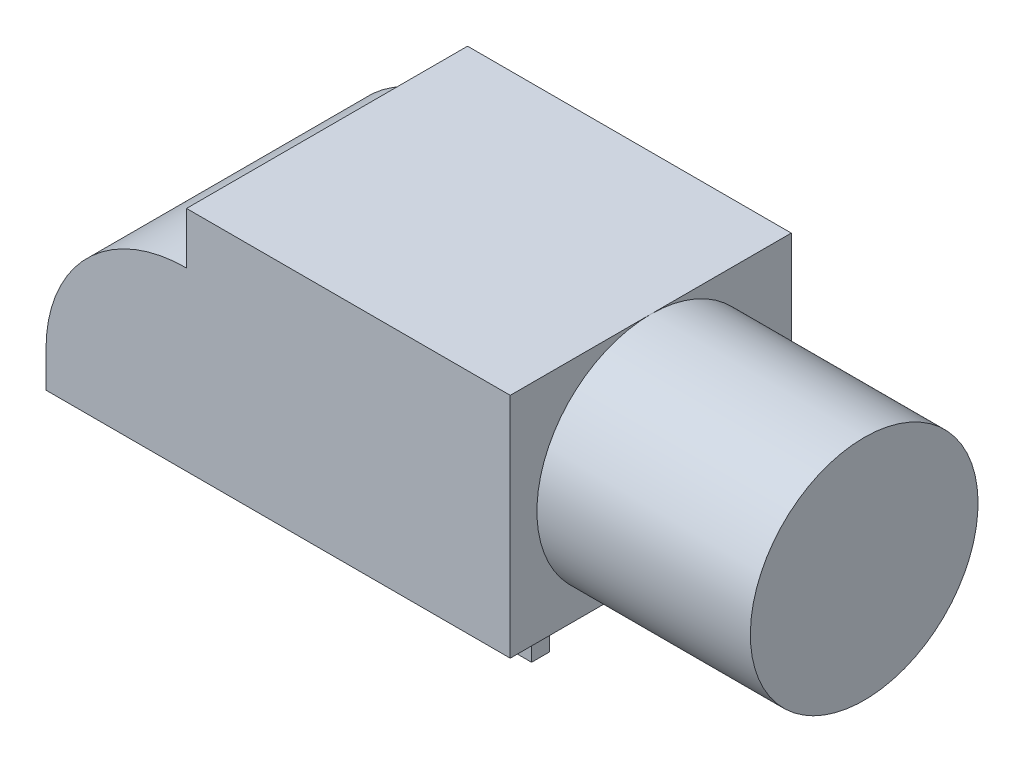
ISO-10303-21;
HEADER;
FILE_DESCRIPTION(('STEP AP214'),'2;1');
FILE_NAME('part.step','',(''),(''),'','','');
FILE_SCHEMA(('AUTOMOTIVE_DESIGN { 1 0 10303 214 1 1 1 1 }'));
ENDSEC;
DATA;
#1=APPLICATION_CONTEXT('core data for automotive mechanical design processes');
#2=APPLICATION_PROTOCOL_DEFINITION('international standard','automotive_design',2000,#1);
#3=PRODUCT_CONTEXT('',#1,'mechanical');
#4=PRODUCT('Part','Part','',(#3));
#5=PRODUCT_RELATED_PRODUCT_CATEGORY('part','',(#4));
#6=PRODUCT_DEFINITION_FORMATION('','',#4);
#7=PRODUCT_DEFINITION_CONTEXT('part definition',#1,'design');
#8=PRODUCT_DEFINITION('design','',#6,#7);
#9=PRODUCT_DEFINITION_SHAPE('','',#8);
#10=(LENGTH_UNIT() NAMED_UNIT(*) SI_UNIT(.MILLI.,.METRE.));
#11=(NAMED_UNIT(*) PLANE_ANGLE_UNIT() SI_UNIT($,.RADIAN.));
#12=(NAMED_UNIT(*) SI_UNIT($,.STERADIAN.) SOLID_ANGLE_UNIT());
#13=UNCERTAINTY_MEASURE_WITH_UNIT(LENGTH_MEASURE(1.E-05),#10,'distance_accuracy_value','');
#14=(GEOMETRIC_REPRESENTATION_CONTEXT(3) GLOBAL_UNCERTAINTY_ASSIGNED_CONTEXT((#13)) GLOBAL_UNIT_ASSIGNED_CONTEXT((#10,
#11,#12)) REPRESENTATION_CONTEXT('',''));
#15=CARTESIAN_POINT('',(0.,0.,0.));
#16=DIRECTION('',(0.,0.,1.));
#17=DIRECTION('',(1.,0.,0.));
#18=AXIS2_PLACEMENT_3D('',#15,#16,#17);
#19=CARTESIAN_POINT('',(-7.875,-4.2,0.));
#20=DIRECTION('',(0.,1.,0.));
#21=DIRECTION('',(0.,0.,1.));
#22=AXIS2_PLACEMENT_3D('',#19,#20,#21);
#23=CYLINDRICAL_SURFACE('',#22,0.75);
#24=CARTESIAN_POINT('',(-7.875,-3.2,0.));
#25=DIRECTION('',(0.,-1.,0.));
#26=DIRECTION('',(0.,0.,1.));
#27=AXIS2_PLACEMENT_3D('',#24,#25,#26);
#28=CIRCLE('',#27,0.75);
#29=CARTESIAN_POINT('',(-7.875,-3.2,0.75));
#30=VERTEX_POINT('',#29);
#31=EDGE_CURVE('E11',#30,#30,#28,.T.);
#32=ORIENTED_EDGE('',*,*,#31,.T.);
#33=EDGE_LOOP('',(#32));
#34=FACE_BOUND('',#33,.T.);
#35=CARTESIAN_POINT('',(-7.875,-4.2,0.));
#36=DIRECTION('',(0.,-1.,0.));
#37=DIRECTION('',(0.,0.,-1.));
#38=AXIS2_PLACEMENT_3D('',#35,#36,#37);
#39=CIRCLE('',#38,0.75);
#40=CARTESIAN_POINT('',(-7.875,-4.2,-0.75));
#41=VERTEX_POINT('',#40);
#42=EDGE_CURVE('E146',#41,#41,#39,.T.);
#43=ORIENTED_EDGE('',*,*,#42,.F.);
#44=EDGE_LOOP('',(#43));
#45=FACE_BOUND('',#44,.T.);
#46=ADVANCED_FACE('F17',(#34,#45),#23,.T.);
#47=CARTESIAN_POINT('',(3.525,0.,0.));
#48=DIRECTION('',(1.,0.,0.));
#49=DIRECTION('',(0.,1.,0.));
#50=AXIS2_PLACEMENT_3D('',#47,#48,#49);
#51=CYLINDRICAL_SURFACE('',#50,3.2);
#52=CARTESIAN_POINT('',(9.525,0.,0.));
#53=DIRECTION('',(1.,0.,0.));
#54=DIRECTION('',(0.,1.,0.));
#55=AXIS2_PLACEMENT_3D('',#52,#53,#54);
#56=CIRCLE('',#55,3.2);
#57=CARTESIAN_POINT('',(9.525,3.2,0.));
#58=VERTEX_POINT('',#57);
#59=EDGE_CURVE('E200',#58,#58,#56,.T.);
#60=ORIENTED_EDGE('',*,*,#59,.F.);
#61=EDGE_LOOP('',(#60));
#62=FACE_BOUND('',#61,.T.);
#63=CARTESIAN_POINT('',(3.525,0.,0.));
#64=DIRECTION('',(1.,0.,0.));
#65=DIRECTION('',(0.,1.,0.));
#66=AXIS2_PLACEMENT_3D('',#63,#64,#65);
#67=CIRCLE('',#66,3.2);
#68=CARTESIAN_POINT('',(3.525,3.2,0.));
#69=VERTEX_POINT('',#68);
#70=CARTESIAN_POINT('',(3.525,-3.2,0.));
#71=VERTEX_POINT('',#70);
#72=EDGE_CURVE('E27',#69,#71,#67,.T.);
#73=ORIENTED_EDGE('',*,*,#72,.T.);
#74=CARTESIAN_POINT('',(3.525,0.,0.));
#75=DIRECTION('',(1.,0.,0.));
#76=DIRECTION('',(0.,1.,0.));
#77=AXIS2_PLACEMENT_3D('',#74,#75,#76);
#78=CIRCLE('',#77,3.2);
#79=EDGE_CURVE('E186',#71,#69,#78,.T.);
#80=ORIENTED_EDGE('',*,*,#79,.T.);
#81=EDGE_LOOP('',(#73,#80));
#82=FACE_BOUND('',#81,.T.);
#83=ADVANCED_FACE('F257',(#62,#82),#51,.T.);
#84=CARTESIAN_POINT('',(-9.525,-3.2,3.95));
#85=DIRECTION('',(0.,1.,0.));
#86=DIRECTION('',(0.,0.,1.));
#87=AXIS2_PLACEMENT_3D('',#84,#85,#86);
#88=PLANE('',#87);
#89=ORIENTED_EDGE('',*,*,#31,.F.);
#90=EDGE_LOOP('',(#89));
#91=FACE_BOUND('',#90,.T.);
#92=DIRECTION('',(0.,0.,1.));
#93=VECTOR('',#92,1.);
#94=CARTESIAN_POINT('',(2.925,-3.2,2.75));
#95=LINE('',#94,#93);
#96=CARTESIAN_POINT('',(2.925,-3.2,2.25));
#97=VERTEX_POINT('',#96);
#98=CARTESIAN_POINT('',(2.925,-3.2,2.75));
#99=VERTEX_POINT('',#98);
#100=EDGE_CURVE('E180',#97,#99,#95,.T.);
#101=ORIENTED_EDGE('',*,*,#100,.F.);
#102=DIRECTION('',(1.,0.,0.));
#103=VECTOR('',#102,1.);
#104=CARTESIAN_POINT('',(1.725,-3.2,2.25));
#105=LINE('',#104,#103);
#106=CARTESIAN_POINT('',(1.725,-3.2,2.25));
#107=VERTEX_POINT('',#106);
#108=EDGE_CURVE('E170',#107,#97,#105,.T.);
#109=ORIENTED_EDGE('',*,*,#108,.F.);
#110=DIRECTION('',(0.,0.,-1.));
#111=VECTOR('',#110,1.);
#112=CARTESIAN_POINT('',(1.725,-3.2,2.75));
#113=LINE('',#112,#111);
#114=CARTESIAN_POINT('',(1.725,-3.2,2.75));
#115=VERTEX_POINT('',#114);
#116=EDGE_CURVE('E176',#115,#107,#113,.T.);
#117=ORIENTED_EDGE('',*,*,#116,.F.);
#118=DIRECTION('',(-1.,0.,0.));
#119=VECTOR('',#118,1.);
#120=CARTESIAN_POINT('',(1.725,-3.2,2.75));
#121=LINE('',#120,#119);
#122=EDGE_CURVE('E181',#99,#115,#121,.T.);
#123=ORIENTED_EDGE('',*,*,#122,.F.);
#124=EDGE_LOOP('',(#101,#109,#117,#123));
#125=FACE_BOUND('',#124,.T.);
#126=DIRECTION('',(0.,0.,-1.));
#127=VECTOR('',#126,1.);
#128=CARTESIAN_POINT('',(3.525,-3.2,3.95));
#129=LINE('',#128,#127);
#130=CARTESIAN_POINT('',(3.525,-3.2,3.95));
#131=VERTEX_POINT('',#130);
#132=EDGE_CURVE('E222',#131,#71,#129,.T.);
#133=ORIENTED_EDGE('',*,*,#132,.F.);
#134=DIRECTION('',(1.,0.,0.));
#135=VECTOR('',#134,1.);
#136=CARTESIAN_POINT('',(-9.525,-3.2,3.95));
#137=LINE('',#136,#135);
#138=CARTESIAN_POINT('',(-9.525,-3.2,3.95));
#139=VERTEX_POINT('',#138);
#140=EDGE_CURVE('E210',#139,#131,#137,.T.);
#141=ORIENTED_EDGE('',*,*,#140,.F.);
#142=DIRECTION('',(0.,0.,-1.));
#143=VECTOR('',#142,1.);
#144=CARTESIAN_POINT('',(-9.525,-3.2,3.95));
#145=LINE('',#144,#143);
#146=CARTESIAN_POINT('',(-9.525,-3.2,-3.95));
#147=VERTEX_POINT('',#146);
#148=EDGE_CURVE('E238',#139,#147,#145,.T.);
#149=ORIENTED_EDGE('',*,*,#148,.T.);
#150=DIRECTION('',(1.,0.,0.));
#151=VECTOR('',#150,1.);
#152=CARTESIAN_POINT('',(-9.525,-3.2,-3.95));
#153=LINE('',#152,#151);
#154=CARTESIAN_POINT('',(3.525,-3.2,-3.95));
#155=VERTEX_POINT('',#154);
#156=EDGE_CURVE('E229',#147,#155,#153,.T.);
#157=ORIENTED_EDGE('',*,*,#156,.T.);
#158=DIRECTION('',(0.,0.,-1.));
#159=VECTOR('',#158,1.);
#160=CARTESIAN_POINT('',(3.525,-3.2,3.95));
#161=LINE('',#160,#159);
#162=EDGE_CURVE('E36',#71,#155,#161,.T.);
#163=ORIENTED_EDGE('',*,*,#162,.F.);
#164=EDGE_LOOP('',(#133,#141,#149,#157,#163));
#165=FACE_BOUND('',#164,.T.);
#166=DIRECTION('',(0.,0.,1.));
#167=VECTOR('',#166,1.);
#168=CARTESIAN_POINT('',(2.925,-3.2,-2.25));
#169=LINE('',#168,#167);
#170=CARTESIAN_POINT('',(2.925,-3.2,-2.75));
#171=VERTEX_POINT('',#170);
#172=CARTESIAN_POINT('',(2.925,-3.2,-2.25));
#173=VERTEX_POINT('',#172);
#174=EDGE_CURVE('E155',#171,#173,#169,.T.);
#175=ORIENTED_EDGE('',*,*,#174,.F.);
#176=DIRECTION('',(1.,0.,0.));
#177=VECTOR('',#176,1.);
#178=CARTESIAN_POINT('',(1.725,-3.2,-2.75));
#179=LINE('',#178,#177);
#180=CARTESIAN_POINT('',(1.725,-3.2,-2.75));
#181=VERTEX_POINT('',#180);
#182=EDGE_CURVE('E139',#181,#171,#179,.T.);
#183=ORIENTED_EDGE('',*,*,#182,.F.);
#184=DIRECTION('',(0.,0.,-1.));
#185=VECTOR('',#184,1.);
#186=CARTESIAN_POINT('',(1.725,-3.2,-2.25));
#187=LINE('',#186,#185);
#188=CARTESIAN_POINT('',(1.725,-3.2,-2.25));
#189=VERTEX_POINT('',#188);
#190=EDGE_CURVE('E137',#189,#181,#187,.T.);
#191=ORIENTED_EDGE('',*,*,#190,.F.);
#192=DIRECTION('',(-1.,0.,0.));
#193=VECTOR('',#192,1.);
#194=CARTESIAN_POINT('',(1.725,-3.2,-2.25));
#195=LINE('',#194,#193);
#196=EDGE_CURVE('E156',#173,#189,#195,.T.);
#197=ORIENTED_EDGE('',*,*,#196,.F.);
#198=EDGE_LOOP('',(#175,#183,#191,#197));
#199=FACE_BOUND('',#198,.T.);
#200=ADVANCED_FACE('F274',(#91,#125,#165,#199),#88,.F.);
#201=CARTESIAN_POINT('',(-9.525,3.2,3.95));
#202=DIRECTION('',(0.,-1.,0.));
#203=DIRECTION('',(0.,0.,-1.));
#204=AXIS2_PLACEMENT_3D('',#201,#202,#203);
#205=PLANE('',#204);
#206=DIRECTION('',(-1.,0.,0.));
#207=VECTOR('',#206,1.);
#208=CARTESIAN_POINT('',(-9.525,3.2,-3.95));
#209=LINE('',#208,#207);
#210=CARTESIAN_POINT('',(3.525,3.2,-3.95));
#211=VERTEX_POINT('',#210);
#212=CARTESIAN_POINT('',(-5.575,3.2,-3.95));
#213=VERTEX_POINT('',#212);
#214=EDGE_CURVE('E214',#211,#213,#209,.T.);
#215=ORIENTED_EDGE('',*,*,#214,.T.);
#216=DIRECTION('',(0.,0.,-1.));
#217=VECTOR('',#216,1.);
#218=CARTESIAN_POINT('',(-5.575,3.2,31.338196020366));
#219=LINE('',#218,#217);
#220=CARTESIAN_POINT('',(-5.575,3.2,3.95));
#221=VERTEX_POINT('',#220);
#222=EDGE_CURVE('E217',#221,#213,#219,.T.);
#223=ORIENTED_EDGE('',*,*,#222,.F.);
#224=DIRECTION('',(-1.,0.,0.));
#225=VECTOR('',#224,1.);
#226=CARTESIAN_POINT('',(-9.525,3.2,3.95));
#227=LINE('',#226,#225);
#228=CARTESIAN_POINT('',(3.525,3.2,3.95));
#229=VERTEX_POINT('',#228);
#230=EDGE_CURVE('E206',#229,#221,#227,.T.);
#231=ORIENTED_EDGE('',*,*,#230,.F.);
#232=DIRECTION('',(0.,0.,1.));
#233=VECTOR('',#232,1.);
#234=CARTESIAN_POINT('',(3.525,3.2,3.95));
#235=LINE('',#234,#233);
#236=EDGE_CURVE('E190',#69,#229,#235,.T.);
#237=ORIENTED_EDGE('',*,*,#236,.F.);
#238=DIRECTION('',(0.,0.,1.));
#239=VECTOR('',#238,1.);
#240=CARTESIAN_POINT('',(3.525,3.2,3.95));
#241=LINE('',#240,#239);
#242=EDGE_CURVE('E220',#211,#69,#241,.T.);
#243=ORIENTED_EDGE('',*,*,#242,.F.);
#244=EDGE_LOOP('',(#215,#223,#231,#237,#243));
#245=FACE_BOUND('',#244,.T.);
#246=ADVANCED_FACE('F266',(#245),#205,.F.);
#247=CARTESIAN_POINT('',(0.,0.,3.95));
#248=DIRECTION('',(0.,0.,1.));
#249=DIRECTION('',(1.,0.,0.));
#250=AXIS2_PLACEMENT_3D('',#247,#248,#249);
#251=PLANE('',#250);
#252=DIRECTION('',(0.,1.,0.));
#253=VECTOR('',#252,1.);
#254=CARTESIAN_POINT('',(-5.575,0.,3.95));
#255=LINE('',#254,#253);
#256=CARTESIAN_POINT('',(-5.575,1.75,3.95));
#257=VERTEX_POINT('',#256);
#258=EDGE_CURVE('E148',#257,#221,#255,.T.);
#259=ORIENTED_EDGE('',*,*,#258,.F.);
#260=CARTESIAN_POINT('',(-5.575,-2.2,3.95));
#261=DIRECTION('',(0.,0.,-1.));
#262=DIRECTION('',(1.,0.,0.));
#263=AXIS2_PLACEMENT_3D('',#260,#261,#262);
#264=CIRCLE('',#263,3.95);
#265=CARTESIAN_POINT('',(-9.525,-2.2,3.95));
#266=VERTEX_POINT('',#265);
#267=EDGE_CURVE('E215',#266,#257,#264,.T.);
#268=ORIENTED_EDGE('',*,*,#267,.F.);
#269=DIRECTION('',(0.,-1.,0.));
#270=VECTOR('',#269,1.);
#271=CARTESIAN_POINT('',(-9.525,3.2,3.95));
#272=LINE('',#271,#270);
#273=EDGE_CURVE('E211',#266,#139,#272,.T.);
#274=ORIENTED_EDGE('',*,*,#273,.T.);
#275=ORIENTED_EDGE('',*,*,#140,.T.);
#276=DIRECTION('',(0.,1.,0.));
#277=VECTOR('',#276,1.);
#278=CARTESIAN_POINT('',(3.525,0.,3.95));
#279=LINE('',#278,#277);
#280=EDGE_CURVE('E207',#131,#229,#279,.T.);
#281=ORIENTED_EDGE('',*,*,#280,.T.);
#282=ORIENTED_EDGE('',*,*,#230,.T.);
#283=EDGE_LOOP('',(#259,#268,#274,#275,#281,#282));
#284=FACE_BOUND('',#283,.T.);
#285=ADVANCED_FACE('F271',(#284),#251,.T.);
#286=CARTESIAN_POINT('',(0.,0.,-3.95));
#287=DIRECTION('',(0.,0.,1.));
#288=DIRECTION('',(1.,0.,0.));
#289=AXIS2_PLACEMENT_3D('',#286,#287,#288);
#290=PLANE('',#289);
#291=CARTESIAN_POINT('',(-5.575,-2.2,-3.95));
#292=DIRECTION('',(0.,0.,-1.));
#293=DIRECTION('',(1.,0.,0.));
#294=AXIS2_PLACEMENT_3D('',#291,#292,#293);
#295=CIRCLE('',#294,3.95);
#296=CARTESIAN_POINT('',(-9.525,-2.2,-3.95));
#297=VERTEX_POINT('',#296);
#298=CARTESIAN_POINT('',(-5.575,1.75,-3.95));
#299=VERTEX_POINT('',#298);
#300=EDGE_CURVE('E203',#297,#299,#295,.T.);
#301=ORIENTED_EDGE('',*,*,#300,.T.);
#302=DIRECTION('',(0.,1.,0.));
#303=VECTOR('',#302,1.);
#304=CARTESIAN_POINT('',(-5.575,0.,-3.95));
#305=LINE('',#304,#303);
#306=EDGE_CURVE('E194',#299,#213,#305,.T.);
#307=ORIENTED_EDGE('',*,*,#306,.T.);
#308=ORIENTED_EDGE('',*,*,#214,.F.);
#309=DIRECTION('',(0.,1.,0.));
#310=VECTOR('',#309,1.);
#311=CARTESIAN_POINT('',(3.525,0.,-3.95));
#312=LINE('',#311,#310);
#313=EDGE_CURVE('E197',#155,#211,#312,.T.);
#314=ORIENTED_EDGE('',*,*,#313,.F.);
#315=ORIENTED_EDGE('',*,*,#156,.F.);
#316=DIRECTION('',(0.,-1.,0.));
#317=VECTOR('',#316,1.);
#318=CARTESIAN_POINT('',(-9.525,3.2,-3.95));
#319=LINE('',#318,#317);
#320=EDGE_CURVE('E189',#297,#147,#319,.T.);
#321=ORIENTED_EDGE('',*,*,#320,.F.);
#322=EDGE_LOOP('',(#301,#307,#308,#314,#315,#321));
#323=FACE_BOUND('',#322,.T.);
#324=ADVANCED_FACE('F281',(#323),#290,.F.);
#325=CARTESIAN_POINT('',(-9.525,3.2,3.95));
#326=DIRECTION('',(1.,0.,0.));
#327=DIRECTION('',(0.,0.,-1.));
#328=AXIS2_PLACEMENT_3D('',#325,#326,#327);
#329=PLANE('',#328);
#330=ORIENTED_EDGE('',*,*,#273,.F.);
#331=DIRECTION('',(0.,0.,-1.));
#332=VECTOR('',#331,1.);
#333=CARTESIAN_POINT('',(-9.525,-2.2,31.338196020366));
#334=LINE('',#333,#332);
#335=EDGE_CURVE('E191',#266,#297,#334,.T.);
#336=ORIENTED_EDGE('',*,*,#335,.T.);
#337=ORIENTED_EDGE('',*,*,#320,.T.);
#338=ORIENTED_EDGE('',*,*,#148,.F.);
#339=EDGE_LOOP('',(#330,#336,#337,#338));
#340=FACE_BOUND('',#339,.T.);
#341=ADVANCED_FACE('F277',(#340),#329,.F.);
#342=CARTESIAN_POINT('',(3.525,0.,0.));
#343=DIRECTION('',(1.,0.,0.));
#344=DIRECTION('',(0.,1.,0.));
#345=AXIS2_PLACEMENT_3D('',#342,#343,#344);
#346=PLANE('',#345);
#347=ORIENTED_EDGE('',*,*,#236,.T.);
#348=ORIENTED_EDGE('',*,*,#280,.F.);
#349=ORIENTED_EDGE('',*,*,#132,.T.);
#350=ORIENTED_EDGE('',*,*,#72,.F.);
#351=EDGE_LOOP('',(#347,#348,#349,#350));
#352=FACE_BOUND('',#351,.T.);
#353=ADVANCED_FACE('F268',(#352),#346,.T.);
#354=CARTESIAN_POINT('',(3.525,0.,0.));
#355=DIRECTION('',(1.,0.,0.));
#356=DIRECTION('',(0.,1.,0.));
#357=AXIS2_PLACEMENT_3D('',#354,#355,#356);
#358=PLANE('',#357);
#359=ORIENTED_EDGE('',*,*,#242,.T.);
#360=ORIENTED_EDGE('',*,*,#79,.F.);
#361=ORIENTED_EDGE('',*,*,#162,.T.);
#362=ORIENTED_EDGE('',*,*,#313,.T.);
#363=EDGE_LOOP('',(#359,#360,#361,#362));
#364=FACE_BOUND('',#363,.T.);
#365=ADVANCED_FACE('F260',(#364),#358,.T.);
#366=CARTESIAN_POINT('',(9.525,3.2,3.95));
#367=DIRECTION('',(-1.,0.,0.));
#368=DIRECTION('',(0.,0.,1.));
#369=AXIS2_PLACEMENT_3D('',#366,#367,#368);
#370=PLANE('',#369);
#371=ORIENTED_EDGE('',*,*,#59,.T.);
#372=EDGE_LOOP('',(#371));
#373=FACE_BOUND('',#372,.T.);
#374=ADVANCED_FACE('F321',(#373),#370,.F.);
#375=CARTESIAN_POINT('',(2.925,-4.2,2.75));
#376=DIRECTION('',(-1.,0.,0.));
#377=DIRECTION('',(0.,0.,1.));
#378=AXIS2_PLACEMENT_3D('',#375,#376,#377);
#379=PLANE('',#378);
#380=ORIENTED_EDGE('',*,*,#100,.T.);
#381=DIRECTION('',(0.,1.,0.));
#382=VECTOR('',#381,1.);
#383=CARTESIAN_POINT('',(2.925,-4.2,2.75));
#384=LINE('',#383,#382);
#385=CARTESIAN_POINT('',(2.925,-4.2,2.75));
#386=VERTEX_POINT('',#385);
#387=EDGE_CURVE('E183',#386,#99,#384,.T.);
#388=ORIENTED_EDGE('',*,*,#387,.F.);
#389=DIRECTION('',(0.,0.,1.));
#390=VECTOR('',#389,1.);
#391=CARTESIAN_POINT('',(2.925,-4.2,2.75));
#392=LINE('',#391,#390);
#393=CARTESIAN_POINT('',(2.925,-4.2,2.25));
#394=VERTEX_POINT('',#393);
#395=EDGE_CURVE('E171',#394,#386,#392,.T.);
#396=ORIENTED_EDGE('',*,*,#395,.F.);
#397=DIRECTION('',(0.,1.,0.));
#398=VECTOR('',#397,1.);
#399=CARTESIAN_POINT('',(2.925,-4.2,2.25));
#400=LINE('',#399,#398);
#401=EDGE_CURVE('E177',#394,#97,#400,.T.);
#402=ORIENTED_EDGE('',*,*,#401,.T.);
#403=EDGE_LOOP('',(#380,#388,#396,#402));
#404=FACE_BOUND('',#403,.T.);
#405=ADVANCED_FACE('F324',(#404),#379,.F.);
#406=CARTESIAN_POINT('',(1.725,-4.2,2.75));
#407=DIRECTION('',(0.,0.,-1.));
#408=DIRECTION('',(-1.,0.,0.));
#409=AXIS2_PLACEMENT_3D('',#406,#407,#408);
#410=PLANE('',#409);
#411=ORIENTED_EDGE('',*,*,#122,.T.);
#412=DIRECTION('',(0.,1.,0.));
#413=VECTOR('',#412,1.);
#414=CARTESIAN_POINT('',(1.725,-4.2,2.75));
#415=LINE('',#414,#413);
#416=CARTESIAN_POINT('',(1.725,-4.2,2.75));
#417=VERTEX_POINT('',#416);
#418=EDGE_CURVE('E173',#417,#115,#415,.T.);
#419=ORIENTED_EDGE('',*,*,#418,.F.);
#420=DIRECTION('',(-1.,0.,0.));
#421=VECTOR('',#420,1.);
#422=CARTESIAN_POINT('',(1.725,-4.2,2.75));
#423=LINE('',#422,#421);
#424=EDGE_CURVE('E166',#386,#417,#423,.T.);
#425=ORIENTED_EDGE('',*,*,#424,.F.);
#426=ORIENTED_EDGE('',*,*,#387,.T.);
#427=EDGE_LOOP('',(#411,#419,#425,#426));
#428=FACE_BOUND('',#427,.T.);
#429=ADVANCED_FACE('F328',(#428),#410,.F.);
#430=CARTESIAN_POINT('',(1.725,-4.2,2.75));
#431=DIRECTION('',(1.,0.,0.));
#432=DIRECTION('',(0.,0.,-1.));
#433=AXIS2_PLACEMENT_3D('',#430,#431,#432);
#434=PLANE('',#433);
#435=ORIENTED_EDGE('',*,*,#116,.T.);
#436=DIRECTION('',(0.,1.,0.));
#437=VECTOR('',#436,1.);
#438=CARTESIAN_POINT('',(1.725,-4.2,2.25));
#439=LINE('',#438,#437);
#440=CARTESIAN_POINT('',(1.725,-4.2,2.25));
#441=VERTEX_POINT('',#440);
#442=EDGE_CURVE('E167',#441,#107,#439,.T.);
#443=ORIENTED_EDGE('',*,*,#442,.F.);
#444=DIRECTION('',(0.,0.,-1.));
#445=VECTOR('',#444,1.);
#446=CARTESIAN_POINT('',(1.725,-4.2,2.75));
#447=LINE('',#446,#445);
#448=EDGE_CURVE('E164',#417,#441,#447,.T.);
#449=ORIENTED_EDGE('',*,*,#448,.F.);
#450=ORIENTED_EDGE('',*,*,#418,.T.);
#451=EDGE_LOOP('',(#435,#443,#449,#450));
#452=FACE_BOUND('',#451,.T.);
#453=ADVANCED_FACE('F332',(#452),#434,.F.);
#454=CARTESIAN_POINT('',(1.725,-4.2,2.25));
#455=DIRECTION('',(0.,0.,1.));
#456=DIRECTION('',(1.,0.,0.));
#457=AXIS2_PLACEMENT_3D('',#454,#455,#456);
#458=PLANE('',#457);
#459=ORIENTED_EDGE('',*,*,#108,.T.);
#460=ORIENTED_EDGE('',*,*,#401,.F.);
#461=DIRECTION('',(1.,0.,0.));
#462=VECTOR('',#461,1.);
#463=CARTESIAN_POINT('',(1.725,-4.2,2.25));
#464=LINE('',#463,#462);
#465=EDGE_CURVE('E161',#441,#394,#464,.T.);
#466=ORIENTED_EDGE('',*,*,#465,.F.);
#467=ORIENTED_EDGE('',*,*,#442,.T.);
#468=EDGE_LOOP('',(#459,#460,#466,#467));
#469=FACE_BOUND('',#468,.T.);
#470=ADVANCED_FACE('F336',(#469),#458,.F.);
#471=CARTESIAN_POINT('',(0.,-4.2,0.));
#472=DIRECTION('',(0.,-1.,0.));
#473=DIRECTION('',(0.,0.,-1.));
#474=AXIS2_PLACEMENT_3D('',#471,#472,#473);
#475=PLANE('',#474);
#476=ORIENTED_EDGE('',*,*,#395,.T.);
#477=ORIENTED_EDGE('',*,*,#424,.T.);
#478=ORIENTED_EDGE('',*,*,#448,.T.);
#479=ORIENTED_EDGE('',*,*,#465,.T.);
#480=EDGE_LOOP('',(#476,#477,#478,#479));
#481=FACE_BOUND('',#480,.T.);
#482=ADVANCED_FACE('F340',(#481),#475,.T.);
#483=CARTESIAN_POINT('',(2.925,-4.2,-2.25));
#484=DIRECTION('',(-1.,0.,0.));
#485=DIRECTION('',(0.,0.,1.));
#486=AXIS2_PLACEMENT_3D('',#483,#484,#485);
#487=PLANE('',#486);
#488=ORIENTED_EDGE('',*,*,#174,.T.);
#489=DIRECTION('',(0.,1.,0.));
#490=VECTOR('',#489,1.);
#491=CARTESIAN_POINT('',(2.925,-4.2,-2.25));
#492=LINE('',#491,#490);
#493=CARTESIAN_POINT('',(2.925,-4.2,-2.25));
#494=VERTEX_POINT('',#493);
#495=EDGE_CURVE('E158',#494,#173,#492,.T.);
#496=ORIENTED_EDGE('',*,*,#495,.F.);
#497=DIRECTION('',(0.,0.,1.));
#498=VECTOR('',#497,1.);
#499=CARTESIAN_POINT('',(2.925,-4.2,-2.25));
#500=LINE('',#499,#498);
#501=CARTESIAN_POINT('',(2.925,-4.2,-2.75));
#502=VERTEX_POINT('',#501);
#503=EDGE_CURVE('E140',#502,#494,#500,.T.);
#504=ORIENTED_EDGE('',*,*,#503,.F.);
#505=DIRECTION('',(0.,1.,0.));
#506=VECTOR('',#505,1.);
#507=CARTESIAN_POINT('',(2.925,-4.2,-2.75));
#508=LINE('',#507,#506);
#509=EDGE_CURVE('E145',#502,#171,#508,.T.);
#510=ORIENTED_EDGE('',*,*,#509,.T.);
#511=EDGE_LOOP('',(#488,#496,#504,#510));
#512=FACE_BOUND('',#511,.T.);
#513=ADVANCED_FACE('F344',(#512),#487,.F.);
#514=CARTESIAN_POINT('',(1.725,-4.2,-2.25));
#515=DIRECTION('',(0.,0.,-1.));
#516=DIRECTION('',(-1.,0.,0.));
#517=AXIS2_PLACEMENT_3D('',#514,#515,#516);
#518=PLANE('',#517);
#519=ORIENTED_EDGE('',*,*,#196,.T.);
#520=DIRECTION('',(0.,1.,0.));
#521=VECTOR('',#520,1.);
#522=CARTESIAN_POINT('',(1.725,-4.2,-2.25));
#523=LINE('',#522,#521);
#524=CARTESIAN_POINT('',(1.725,-4.2,-2.25));
#525=VERTEX_POINT('',#524);
#526=EDGE_CURVE('E152',#525,#189,#523,.T.);
#527=ORIENTED_EDGE('',*,*,#526,.F.);
#528=DIRECTION('',(-1.,0.,0.));
#529=VECTOR('',#528,1.);
#530=CARTESIAN_POINT('',(1.725,-4.2,-2.25));
#531=LINE('',#530,#529);
#532=EDGE_CURVE('E121',#494,#525,#531,.T.);
#533=ORIENTED_EDGE('',*,*,#532,.F.);
#534=ORIENTED_EDGE('',*,*,#495,.T.);
#535=EDGE_LOOP('',(#519,#527,#533,#534));
#536=FACE_BOUND('',#535,.T.);
#537=ADVANCED_FACE('F348',(#536),#518,.F.);
#538=CARTESIAN_POINT('',(1.725,-4.2,-2.25));
#539=DIRECTION('',(1.,0.,0.));
#540=DIRECTION('',(0.,0.,-1.));
#541=AXIS2_PLACEMENT_3D('',#538,#539,#540);
#542=PLANE('',#541);
#543=ORIENTED_EDGE('',*,*,#190,.T.);
#544=DIRECTION('',(0.,1.,0.));
#545=VECTOR('',#544,1.);
#546=CARTESIAN_POINT('',(1.725,-4.2,-2.75));
#547=LINE('',#546,#545);
#548=CARTESIAN_POINT('',(1.725,-4.2,-2.75));
#549=VERTEX_POINT('',#548);
#550=EDGE_CURVE('E135',#549,#181,#547,.T.);
#551=ORIENTED_EDGE('',*,*,#550,.F.);
#552=DIRECTION('',(0.,0.,-1.));
#553=VECTOR('',#552,1.);
#554=CARTESIAN_POINT('',(1.725,-4.2,-2.25));
#555=LINE('',#554,#553);
#556=EDGE_CURVE('E125',#525,#549,#555,.T.);
#557=ORIENTED_EDGE('',*,*,#556,.F.);
#558=ORIENTED_EDGE('',*,*,#526,.T.);
#559=EDGE_LOOP('',(#543,#551,#557,#558));
#560=FACE_BOUND('',#559,.T.);
#561=ADVANCED_FACE('F136',(#560),#542,.F.);
#562=CARTESIAN_POINT('',(1.725,-4.2,-2.75));
#563=DIRECTION('',(0.,0.,1.));
#564=DIRECTION('',(1.,0.,0.));
#565=AXIS2_PLACEMENT_3D('',#562,#563,#564);
#566=PLANE('',#565);
#567=ORIENTED_EDGE('',*,*,#182,.T.);
#568=ORIENTED_EDGE('',*,*,#509,.F.);
#569=DIRECTION('',(1.,0.,0.));
#570=VECTOR('',#569,1.);
#571=CARTESIAN_POINT('',(1.725,-4.2,-2.75));
#572=LINE('',#571,#570);
#573=EDGE_CURVE('E129',#549,#502,#572,.T.);
#574=ORIENTED_EDGE('',*,*,#573,.F.);
#575=ORIENTED_EDGE('',*,*,#550,.T.);
#576=EDGE_LOOP('',(#567,#568,#574,#575));
#577=FACE_BOUND('',#576,.T.);
#578=ADVANCED_FACE('F143',(#577),#566,.F.);
#579=CARTESIAN_POINT('',(0.,-4.2,0.));
#580=DIRECTION('',(0.,-1.,0.));
#581=DIRECTION('',(0.,0.,-1.));
#582=AXIS2_PLACEMENT_3D('',#579,#580,#581);
#583=PLANE('',#582);
#584=ORIENTED_EDGE('',*,*,#503,.T.);
#585=ORIENTED_EDGE('',*,*,#532,.T.);
#586=ORIENTED_EDGE('',*,*,#556,.T.);
#587=ORIENTED_EDGE('',*,*,#573,.T.);
#588=EDGE_LOOP('',(#584,#585,#586,#587));
#589=FACE_BOUND('',#588,.T.);
#590=ADVANCED_FACE('F127',(#589),#583,.T.);
#591=CARTESIAN_POINT('',(-7.875,-4.2,0.));
#592=DIRECTION('',(0.,-1.,0.));
#593=DIRECTION('',(0.,0.,-1.));
#594=AXIS2_PLACEMENT_3D('',#591,#592,#593);
#595=PLANE('',#594);
#596=ORIENTED_EDGE('',*,*,#42,.T.);
#597=EDGE_LOOP('',(#596));
#598=FACE_BOUND('',#597,.T.);
#599=ADVANCED_FACE('F288',(#598),#595,.T.);
#600=CARTESIAN_POINT('',(-5.575,3.2,31.338196020366));
#601=DIRECTION('',(1.,0.,0.));
#602=DIRECTION('',(0.,1.,0.));
#603=AXIS2_PLACEMENT_3D('',#600,#601,#602);
#604=PLANE('',#603);
#605=DIRECTION('',(0.,0.,-1.));
#606=VECTOR('',#605,1.);
#607=CARTESIAN_POINT('',(-5.575,1.75,31.338196020366));
#608=LINE('',#607,#606);
#609=EDGE_CURVE('E21',#257,#299,#608,.T.);
#610=ORIENTED_EDGE('',*,*,#609,.F.);
#611=ORIENTED_EDGE('',*,*,#258,.T.);
#612=ORIENTED_EDGE('',*,*,#222,.T.);
#613=ORIENTED_EDGE('',*,*,#306,.F.);
#614=EDGE_LOOP('',(#610,#611,#612,#613));
#615=FACE_BOUND('',#614,.T.);
#616=ADVANCED_FACE('F286',(#615),#604,.F.);
#617=CARTESIAN_POINT('',(-5.575,-2.2,31.338196020366));
#618=DIRECTION('',(0.,0.,-1.));
#619=DIRECTION('',(-1.,0.,0.));
#620=AXIS2_PLACEMENT_3D('',#617,#618,#619);
#621=CYLINDRICAL_SURFACE('',#620,3.95);
#622=ORIENTED_EDGE('',*,*,#335,.F.);
#623=ORIENTED_EDGE('',*,*,#267,.T.);
#624=ORIENTED_EDGE('',*,*,#609,.T.);
#625=ORIENTED_EDGE('',*,*,#300,.F.);
#626=EDGE_LOOP('',(#622,#623,#624,#625));
#627=FACE_BOUND('',#626,.T.);
#628=ADVANCED_FACE('F19',(#627),#621,.T.);
#629=CLOSED_SHELL('',(#46,#83,#200,#246,#285,#324,#341,#353,#365,#374,#405,#429,#453,#470,#482,
#513,#537,#561,#578,#590,#599,#616,#628));
#630=MANIFOLD_SOLID_BREP('B1',#629);
#631=ADVANCED_BREP_SHAPE_REPRESENTATION('',(#18,#630),#14);
#632=SHAPE_DEFINITION_REPRESENTATION(#9,#631);
ENDSEC;
END-ISO-10303-21;
